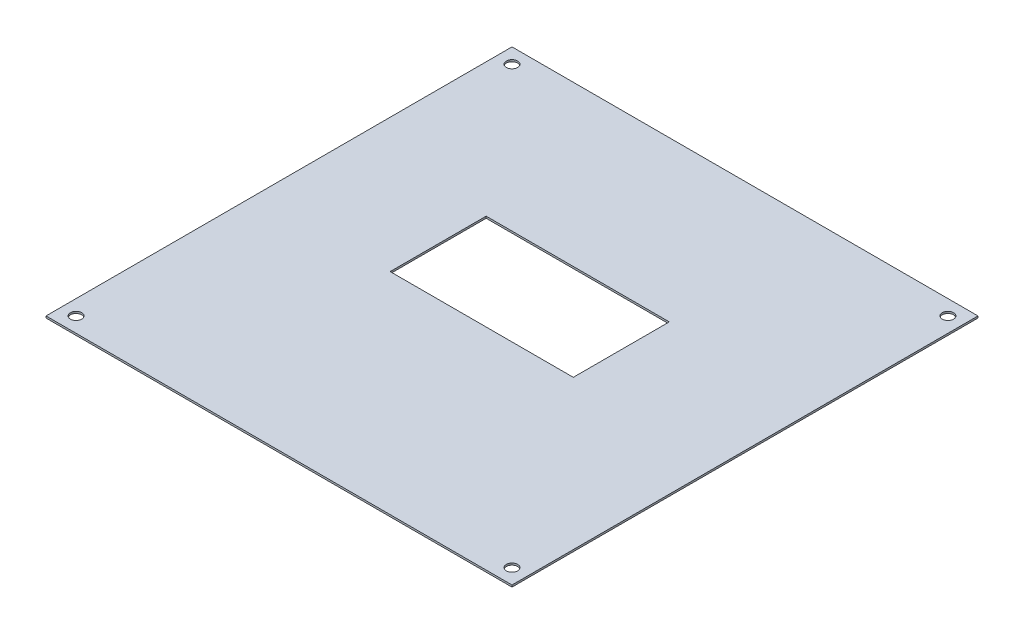
ISO-10303-21;
HEADER;
FILE_DESCRIPTION(('STEP AP214'),'2;1');
FILE_NAME('part.step','',(''),(''),'','','');
FILE_SCHEMA(('AUTOMOTIVE_DESIGN { 1 0 10303 214 1 1 1 1 }'));
ENDSEC;
DATA;
#1=APPLICATION_CONTEXT('core data for automotive mechanical design processes');
#2=APPLICATION_PROTOCOL_DEFINITION('international standard','automotive_design',2000,#1);
#3=PRODUCT_CONTEXT('',#1,'mechanical');
#4=PRODUCT('Part','Part','',(#3));
#5=PRODUCT_RELATED_PRODUCT_CATEGORY('part','',(#4));
#6=PRODUCT_DEFINITION_FORMATION('','',#4);
#7=PRODUCT_DEFINITION_CONTEXT('part definition',#1,'design');
#8=PRODUCT_DEFINITION('design','',#6,#7);
#9=PRODUCT_DEFINITION_SHAPE('','',#8);
#10=(LENGTH_UNIT() NAMED_UNIT(*) SI_UNIT(.MILLI.,.METRE.));
#11=(NAMED_UNIT(*) PLANE_ANGLE_UNIT() SI_UNIT($,.RADIAN.));
#12=(NAMED_UNIT(*) SI_UNIT($,.STERADIAN.) SOLID_ANGLE_UNIT());
#13=UNCERTAINTY_MEASURE_WITH_UNIT(LENGTH_MEASURE(1.E-05),#10,'distance_accuracy_value','');
#14=(GEOMETRIC_REPRESENTATION_CONTEXT(3) GLOBAL_UNCERTAINTY_ASSIGNED_CONTEXT((#13)) GLOBAL_UNIT_ASSIGNED_CONTEXT((#10,
#11,#12)) REPRESENTATION_CONTEXT('',''));
#15=CARTESIAN_POINT('',(0.,0.,0.));
#16=DIRECTION('',(0.,0.,1.));
#17=DIRECTION('',(1.,0.,0.));
#18=AXIS2_PLACEMENT_3D('',#15,#16,#17);
#19=CARTESIAN_POINT('',(0.,0.5,0.));
#20=DIRECTION('',(0.,-1.,0.));
#21=DIRECTION('',(0.,0.,-1.));
#22=AXIS2_PLACEMENT_3D('',#19,#20,#21);
#23=PLANE('',#22);
#24=CARTESIAN_POINT('',(120.,0.5,-4.));
#25=DIRECTION('',(0.,1.,0.));
#26=DIRECTION('',(0.,0.,1.));
#27=AXIS2_PLACEMENT_3D('',#24,#25,#26);
#28=CIRCLE('',#27,1.5);
#29=CARTESIAN_POINT('',(120.,0.5,-2.5));
#30=VERTEX_POINT('',#29);
#31=EDGE_CURVE('E250',#30,#30,#28,.T.);
#32=ORIENTED_EDGE('',*,*,#31,.F.);
#33=EDGE_LOOP('',(#32));
#34=FACE_BOUND('',#33,.T.);
#35=CARTESIAN_POINT('',(4.,0.5,-120.));
#36=DIRECTION('',(0.,1.,0.));
#37=DIRECTION('',(0.,0.,1.));
#38=AXIS2_PLACEMENT_3D('',#35,#36,#37);
#39=CIRCLE('',#38,1.5);
#40=CARTESIAN_POINT('',(4.,0.5,-118.5));
#41=VERTEX_POINT('',#40);
#42=EDGE_CURVE('E131',#41,#41,#39,.T.);
#43=ORIENTED_EDGE('',*,*,#42,.F.);
#44=EDGE_LOOP('',(#43));
#45=FACE_BOUND('',#44,.T.);
#46=DIRECTION('',(0.,0.,1.));
#47=VECTOR('',#46,1.);
#48=CARTESIAN_POINT('',(0.,0.5,0.));
#49=LINE('',#48,#47);
#50=CARTESIAN_POINT('',(0.,0.5,-124.));
#51=VERTEX_POINT('',#50);
#52=CARTESIAN_POINT('',(0.,0.5,0.));
#53=VERTEX_POINT('',#52);
#54=EDGE_CURVE('E141',#51,#53,#49,.T.);
#55=ORIENTED_EDGE('',*,*,#54,.T.);
#56=DIRECTION('',(1.,0.,0.));
#57=VECTOR('',#56,1.);
#58=CARTESIAN_POINT('',(0.,0.5,0.));
#59=LINE('',#58,#57);
#60=CARTESIAN_POINT('',(124.,0.5,0.));
#61=VERTEX_POINT('',#60);
#62=EDGE_CURVE('E144',#53,#61,#59,.T.);
#63=ORIENTED_EDGE('',*,*,#62,.T.);
#64=DIRECTION('',(0.,0.,-1.));
#65=VECTOR('',#64,1.);
#66=CARTESIAN_POINT('',(124.,0.5,0.));
#67=LINE('',#66,#65);
#68=CARTESIAN_POINT('',(124.,0.5,-124.));
#69=VERTEX_POINT('',#68);
#70=EDGE_CURVE('E147',#61,#69,#67,.T.);
#71=ORIENTED_EDGE('',*,*,#70,.T.);
#72=DIRECTION('',(-1.,0.,0.));
#73=VECTOR('',#72,1.);
#74=CARTESIAN_POINT('',(0.,0.5,-124.));
#75=LINE('',#74,#73);
#76=EDGE_CURVE('E149',#69,#51,#75,.T.);
#77=ORIENTED_EDGE('',*,*,#76,.T.);
#78=EDGE_LOOP('',(#55,#63,#71,#77));
#79=FACE_BOUND('',#78,.T.);
#80=DIRECTION('',(0.,0.,1.));
#81=VECTOR('',#80,1.);
#82=CARTESIAN_POINT('',(35.5689381933439,0.5,-81.5530903328051));
#83=LINE('',#82,#81);
#84=CARTESIAN_POINT('',(35.5689381933439,0.5,-81.5530903328051));
#85=VERTEX_POINT('',#84);
#86=CARTESIAN_POINT('',(35.5689381933439,0.5,-56.0063391442155));
#87=VERTEX_POINT('',#86);
#88=EDGE_CURVE('E102',#85,#87,#83,.T.);
#89=ORIENTED_EDGE('',*,*,#88,.F.);
#90=DIRECTION('',(-1.,0.,0.));
#91=VECTOR('',#90,1.);
#92=CARTESIAN_POINT('',(35.5689381933439,0.5,-81.5530903328051));
#93=LINE('',#92,#91);
#94=CARTESIAN_POINT('',(84.3042789223455,0.5,-81.5530903328051));
#95=VERTEX_POINT('',#94);
#96=EDGE_CURVE('E125',#95,#85,#93,.T.);
#97=ORIENTED_EDGE('',*,*,#96,.F.);
#98=DIRECTION('',(0.,0.,-1.));
#99=VECTOR('',#98,1.);
#100=CARTESIAN_POINT('',(84.3042789223455,0.5,-81.5530903328051));
#101=LINE('',#100,#99);
#102=CARTESIAN_POINT('',(84.3042789223455,0.5,-56.0063391442155));
#103=VERTEX_POINT('',#102);
#104=EDGE_CURVE('E123',#103,#95,#101,.T.);
#105=ORIENTED_EDGE('',*,*,#104,.F.);
#106=DIRECTION('',(1.,0.,0.));
#107=VECTOR('',#106,1.);
#108=CARTESIAN_POINT('',(35.5689381933439,0.5,-56.0063391442155));
#109=LINE('',#108,#107);
#110=EDGE_CURVE('E110',#87,#103,#109,.T.);
#111=ORIENTED_EDGE('',*,*,#110,.F.);
#112=EDGE_LOOP('',(#89,#97,#105,#111));
#113=FACE_BOUND('',#112,.T.);
#114=CARTESIAN_POINT('',(120.,0.5,-120.));
#115=DIRECTION('',(0.,1.,0.));
#116=DIRECTION('',(0.,0.,1.));
#117=AXIS2_PLACEMENT_3D('',#114,#115,#116);
#118=CIRCLE('',#117,1.5);
#119=CARTESIAN_POINT('',(120.,0.5,-118.5));
#120=VERTEX_POINT('',#119);
#121=EDGE_CURVE('E256',#120,#120,#118,.T.);
#122=ORIENTED_EDGE('',*,*,#121,.F.);
#123=EDGE_LOOP('',(#122));
#124=FACE_BOUND('',#123,.T.);
#125=CARTESIAN_POINT('',(4.,0.5,-4.));
#126=DIRECTION('',(0.,1.,0.));
#127=DIRECTION('',(0.,0.,1.));
#128=AXIS2_PLACEMENT_3D('',#125,#126,#127);
#129=CIRCLE('',#128,1.5);
#130=CARTESIAN_POINT('',(4.,0.5,-2.5));
#131=VERTEX_POINT('',#130);
#132=EDGE_CURVE('E241',#131,#131,#129,.T.);
#133=ORIENTED_EDGE('',*,*,#132,.F.);
#134=EDGE_LOOP('',(#133));
#135=FACE_BOUND('',#134,.T.);
#136=ADVANCED_FACE('F37',(#34,#45,#79,#113,#124,#135),#23,.F.);
#137=CARTESIAN_POINT('',(0.,0.,0.));
#138=DIRECTION('',(0.,-1.,0.));
#139=DIRECTION('',(0.,0.,-1.));
#140=AXIS2_PLACEMENT_3D('',#137,#138,#139);
#141=PLANE('',#140);
#142=CARTESIAN_POINT('',(120.,0.,-4.));
#143=DIRECTION('',(0.,1.,0.));
#144=DIRECTION('',(0.,0.,1.));
#145=AXIS2_PLACEMENT_3D('',#142,#143,#144);
#146=CIRCLE('',#145,1.5);
#147=CARTESIAN_POINT('',(120.,0.,-2.5));
#148=VERTEX_POINT('',#147);
#149=EDGE_CURVE('E247',#148,#148,#146,.T.);
#150=ORIENTED_EDGE('',*,*,#149,.T.);
#151=EDGE_LOOP('',(#150));
#152=FACE_BOUND('',#151,.T.);
#153=CARTESIAN_POINT('',(4.,0.,-120.));
#154=DIRECTION('',(0.,1.,0.));
#155=DIRECTION('',(0.,0.,1.));
#156=AXIS2_PLACEMENT_3D('',#153,#154,#155);
#157=CIRCLE('',#156,1.5);
#158=CARTESIAN_POINT('',(4.,0.,-118.5));
#159=VERTEX_POINT('',#158);
#160=EDGE_CURVE('E259',#159,#159,#157,.T.);
#161=ORIENTED_EDGE('',*,*,#160,.T.);
#162=EDGE_LOOP('',(#161));
#163=FACE_BOUND('',#162,.T.);
#164=DIRECTION('',(0.,0.,1.));
#165=VECTOR('',#164,1.);
#166=CARTESIAN_POINT('',(0.,0.,0.));
#167=LINE('',#166,#165);
#168=CARTESIAN_POINT('',(0.,0.,-124.));
#169=VERTEX_POINT('',#168);
#170=CARTESIAN_POINT('',(0.,0.,0.));
#171=VERTEX_POINT('',#170);
#172=EDGE_CURVE('E118',#169,#171,#167,.T.);
#173=ORIENTED_EDGE('',*,*,#172,.F.);
#174=DIRECTION('',(-1.,0.,0.));
#175=VECTOR('',#174,1.);
#176=CARTESIAN_POINT('',(0.,0.,-124.));
#177=LINE('',#176,#175);
#178=CARTESIAN_POINT('',(124.,0.,-124.));
#179=VERTEX_POINT('',#178);
#180=EDGE_CURVE('E145',#179,#169,#177,.T.);
#181=ORIENTED_EDGE('',*,*,#180,.F.);
#182=DIRECTION('',(0.,0.,-1.));
#183=VECTOR('',#182,1.);
#184=CARTESIAN_POINT('',(124.,0.,0.));
#185=LINE('',#184,#183);
#186=CARTESIAN_POINT('',(124.,0.,0.));
#187=VERTEX_POINT('',#186);
#188=EDGE_CURVE('E156',#187,#179,#185,.T.);
#189=ORIENTED_EDGE('',*,*,#188,.F.);
#190=DIRECTION('',(1.,0.,0.));
#191=VECTOR('',#190,1.);
#192=CARTESIAN_POINT('',(0.,0.,0.));
#193=LINE('',#192,#191);
#194=EDGE_CURVE('E154',#171,#187,#193,.T.);
#195=ORIENTED_EDGE('',*,*,#194,.F.);
#196=EDGE_LOOP('',(#173,#181,#189,#195));
#197=FACE_BOUND('',#196,.T.);
#198=DIRECTION('',(-1.,0.,0.));
#199=VECTOR('',#198,1.);
#200=CARTESIAN_POINT('',(35.5689381933439,0.,-81.5530903328051));
#201=LINE('',#200,#199);
#202=CARTESIAN_POINT('',(84.3042789223455,0.,-81.5530903328051));
#203=VERTEX_POINT('',#202);
#204=CARTESIAN_POINT('',(35.5689381933439,0.,-81.5530903328051));
#205=VERTEX_POINT('',#204);
#206=EDGE_CURVE('E111',#203,#205,#201,.T.);
#207=ORIENTED_EDGE('',*,*,#206,.T.);
#208=DIRECTION('',(0.,0.,1.));
#209=VECTOR('',#208,1.);
#210=CARTESIAN_POINT('',(35.5689381933439,0.,-81.5530903328051));
#211=LINE('',#210,#209);
#212=CARTESIAN_POINT('',(35.5689381933439,0.,-56.0063391442155));
#213=VERTEX_POINT('',#212);
#214=EDGE_CURVE('E60',#205,#213,#211,.T.);
#215=ORIENTED_EDGE('',*,*,#214,.T.);
#216=DIRECTION('',(1.,0.,0.));
#217=VECTOR('',#216,1.);
#218=CARTESIAN_POINT('',(35.5689381933439,0.,-56.0063391442155));
#219=LINE('',#218,#217);
#220=CARTESIAN_POINT('',(84.3042789223455,0.,-56.0063391442155));
#221=VERTEX_POINT('',#220);
#222=EDGE_CURVE('E117',#213,#221,#219,.T.);
#223=ORIENTED_EDGE('',*,*,#222,.T.);
#224=DIRECTION('',(0.,0.,-1.));
#225=VECTOR('',#224,1.);
#226=CARTESIAN_POINT('',(84.3042789223455,0.,-81.5530903328051));
#227=LINE('',#226,#225);
#228=EDGE_CURVE('E133',#221,#203,#227,.T.);
#229=ORIENTED_EDGE('',*,*,#228,.T.);
#230=EDGE_LOOP('',(#207,#215,#223,#229));
#231=FACE_BOUND('',#230,.T.);
#232=CARTESIAN_POINT('',(120.,0.,-120.));
#233=DIRECTION('',(0.,1.,0.));
#234=DIRECTION('',(0.,0.,1.));
#235=AXIS2_PLACEMENT_3D('',#232,#233,#234);
#236=CIRCLE('',#235,1.5);
#237=CARTESIAN_POINT('',(120.,0.,-118.5));
#238=VERTEX_POINT('',#237);
#239=EDGE_CURVE('E253',#238,#238,#236,.T.);
#240=ORIENTED_EDGE('',*,*,#239,.T.);
#241=EDGE_LOOP('',(#240));
#242=FACE_BOUND('',#241,.T.);
#243=CARTESIAN_POINT('',(4.,0.,-4.));
#244=DIRECTION('',(0.,1.,0.));
#245=DIRECTION('',(0.,0.,1.));
#246=AXIS2_PLACEMENT_3D('',#243,#244,#245);
#247=CIRCLE('',#246,1.5);
#248=CARTESIAN_POINT('',(4.,0.,-2.5));
#249=VERTEX_POINT('',#248);
#250=EDGE_CURVE('E244',#249,#249,#247,.T.);
#251=ORIENTED_EDGE('',*,*,#250,.T.);
#252=EDGE_LOOP('',(#251));
#253=FACE_BOUND('',#252,.T.);
#254=ADVANCED_FACE('F174',(#152,#163,#197,#231,#242,#253),#141,.T.);
#255=CARTESIAN_POINT('',(0.,0.5,0.));
#256=DIRECTION('',(1.,0.,0.));
#257=DIRECTION('',(0.,0.,-1.));
#258=AXIS2_PLACEMENT_3D('',#255,#256,#257);
#259=PLANE('',#258);
#260=ORIENTED_EDGE('',*,*,#172,.T.);
#261=DIRECTION('',(0.,-1.,0.));
#262=VECTOR('',#261,1.);
#263=CARTESIAN_POINT('',(0.,0.5,0.));
#264=LINE('',#263,#262);
#265=EDGE_CURVE('E11',#53,#171,#264,.T.);
#266=ORIENTED_EDGE('',*,*,#265,.F.);
#267=ORIENTED_EDGE('',*,*,#54,.F.);
#268=DIRECTION('',(0.,-1.,0.));
#269=VECTOR('',#268,1.);
#270=CARTESIAN_POINT('',(0.,0.5,-124.));
#271=LINE('',#270,#269);
#272=EDGE_CURVE('E151',#51,#169,#271,.T.);
#273=ORIENTED_EDGE('',*,*,#272,.T.);
#274=EDGE_LOOP('',(#260,#266,#267,#273));
#275=FACE_BOUND('',#274,.T.);
#276=ADVANCED_FACE('F39',(#275),#259,.F.);
#277=CARTESIAN_POINT('',(0.,0.5,0.));
#278=DIRECTION('',(0.,0.,-1.));
#279=DIRECTION('',(-1.,0.,0.));
#280=AXIS2_PLACEMENT_3D('',#277,#278,#279);
#281=PLANE('',#280);
#282=ORIENTED_EDGE('',*,*,#194,.T.);
#283=DIRECTION('',(0.,-1.,0.));
#284=VECTOR('',#283,1.);
#285=CARTESIAN_POINT('',(124.,0.5,0.));
#286=LINE('',#285,#284);
#287=EDGE_CURVE('E45',#61,#187,#286,.T.);
#288=ORIENTED_EDGE('',*,*,#287,.F.);
#289=ORIENTED_EDGE('',*,*,#62,.F.);
#290=ORIENTED_EDGE('',*,*,#265,.T.);
#291=EDGE_LOOP('',(#282,#288,#289,#290));
#292=FACE_BOUND('',#291,.T.);
#293=ADVANCED_FACE('F184',(#292),#281,.F.);
#294=CARTESIAN_POINT('',(124.,0.5,0.));
#295=DIRECTION('',(-1.,0.,0.));
#296=DIRECTION('',(0.,0.,1.));
#297=AXIS2_PLACEMENT_3D('',#294,#295,#296);
#298=PLANE('',#297);
#299=ORIENTED_EDGE('',*,*,#188,.T.);
#300=DIRECTION('',(0.,-1.,0.));
#301=VECTOR('',#300,1.);
#302=CARTESIAN_POINT('',(124.,0.5,-124.));
#303=LINE('',#302,#301);
#304=EDGE_CURVE('E161',#69,#179,#303,.T.);
#305=ORIENTED_EDGE('',*,*,#304,.F.);
#306=ORIENTED_EDGE('',*,*,#70,.F.);
#307=ORIENTED_EDGE('',*,*,#287,.T.);
#308=EDGE_LOOP('',(#299,#305,#306,#307));
#309=FACE_BOUND('',#308,.T.);
#310=ADVANCED_FACE('F168',(#309),#298,.F.);
#311=CARTESIAN_POINT('',(0.,0.5,-124.));
#312=DIRECTION('',(0.,0.,1.));
#313=DIRECTION('',(1.,0.,0.));
#314=AXIS2_PLACEMENT_3D('',#311,#312,#313);
#315=PLANE('',#314);
#316=ORIENTED_EDGE('',*,*,#180,.T.);
#317=ORIENTED_EDGE('',*,*,#272,.F.);
#318=ORIENTED_EDGE('',*,*,#76,.F.);
#319=ORIENTED_EDGE('',*,*,#304,.T.);
#320=EDGE_LOOP('',(#316,#317,#318,#319));
#321=FACE_BOUND('',#320,.T.);
#322=ADVANCED_FACE('F178',(#321),#315,.F.);
#323=CARTESIAN_POINT('',(35.5689381933439,0.5,-81.5530903328051));
#324=DIRECTION('',(1.,0.,0.));
#325=DIRECTION('',(0.,0.,-1.));
#326=AXIS2_PLACEMENT_3D('',#323,#324,#325);
#327=PLANE('',#326);
#328=ORIENTED_EDGE('',*,*,#214,.F.);
#329=DIRECTION('',(0.,-1.,0.));
#330=VECTOR('',#329,1.);
#331=CARTESIAN_POINT('',(35.5689381933439,0.5,-81.5530903328051));
#332=LINE('',#331,#330);
#333=EDGE_CURVE('E106',#85,#205,#332,.T.);
#334=ORIENTED_EDGE('',*,*,#333,.F.);
#335=ORIENTED_EDGE('',*,*,#88,.T.);
#336=DIRECTION('',(0.,-1.,0.));
#337=VECTOR('',#336,1.);
#338=CARTESIAN_POINT('',(35.5689381933439,0.5,-56.0063391442155));
#339=LINE('',#338,#337);
#340=EDGE_CURVE('E105',#87,#213,#339,.T.);
#341=ORIENTED_EDGE('',*,*,#340,.T.);
#342=EDGE_LOOP('',(#328,#334,#335,#341));
#343=FACE_BOUND('',#342,.T.);
#344=ADVANCED_FACE('F104',(#343),#327,.T.);
#345=CARTESIAN_POINT('',(35.5689381933439,0.5,-56.0063391442155));
#346=DIRECTION('',(0.,0.,-1.));
#347=DIRECTION('',(-1.,0.,0.));
#348=AXIS2_PLACEMENT_3D('',#345,#346,#347);
#349=PLANE('',#348);
#350=ORIENTED_EDGE('',*,*,#222,.F.);
#351=ORIENTED_EDGE('',*,*,#340,.F.);
#352=ORIENTED_EDGE('',*,*,#110,.T.);
#353=DIRECTION('',(0.,-1.,0.));
#354=VECTOR('',#353,1.);
#355=CARTESIAN_POINT('',(84.3042789223455,0.5,-56.0063391442155));
#356=LINE('',#355,#354);
#357=EDGE_CURVE('E119',#103,#221,#356,.T.);
#358=ORIENTED_EDGE('',*,*,#357,.T.);
#359=EDGE_LOOP('',(#350,#351,#352,#358));
#360=FACE_BOUND('',#359,.T.);
#361=ADVANCED_FACE('F114',(#360),#349,.T.);
#362=CARTESIAN_POINT('',(84.3042789223455,0.5,-81.5530903328051));
#363=DIRECTION('',(-1.,0.,0.));
#364=DIRECTION('',(0.,0.,1.));
#365=AXIS2_PLACEMENT_3D('',#362,#363,#364);
#366=PLANE('',#365);
#367=ORIENTED_EDGE('',*,*,#228,.F.);
#368=ORIENTED_EDGE('',*,*,#357,.F.);
#369=ORIENTED_EDGE('',*,*,#104,.T.);
#370=DIRECTION('',(0.,-1.,0.));
#371=VECTOR('',#370,1.);
#372=CARTESIAN_POINT('',(84.3042789223455,0.5,-81.5530903328051));
#373=LINE('',#372,#371);
#374=EDGE_CURVE('E52',#95,#203,#373,.T.);
#375=ORIENTED_EDGE('',*,*,#374,.T.);
#376=EDGE_LOOP('',(#367,#368,#369,#375));
#377=FACE_BOUND('',#376,.T.);
#378=ADVANCED_FACE('F211',(#377),#366,.T.);
#379=CARTESIAN_POINT('',(35.5689381933439,0.5,-81.5530903328051));
#380=DIRECTION('',(0.,0.,1.));
#381=DIRECTION('',(1.,0.,0.));
#382=AXIS2_PLACEMENT_3D('',#379,#380,#381);
#383=PLANE('',#382);
#384=ORIENTED_EDGE('',*,*,#206,.F.);
#385=ORIENTED_EDGE('',*,*,#374,.F.);
#386=ORIENTED_EDGE('',*,*,#96,.T.);
#387=ORIENTED_EDGE('',*,*,#333,.T.);
#388=EDGE_LOOP('',(#384,#385,#386,#387));
#389=FACE_BOUND('',#388,.T.);
#390=ADVANCED_FACE('F215',(#389),#383,.T.);
#391=CARTESIAN_POINT('',(4.,0.5,-120.));
#392=DIRECTION('',(0.,-1.,0.));
#393=DIRECTION('',(0.,0.,-1.));
#394=AXIS2_PLACEMENT_3D('',#391,#392,#393);
#395=CYLINDRICAL_SURFACE('',#394,1.5);
#396=ORIENTED_EDGE('',*,*,#42,.T.);
#397=EDGE_LOOP('',(#396));
#398=FACE_BOUND('',#397,.T.);
#399=ORIENTED_EDGE('',*,*,#160,.F.);
#400=EDGE_LOOP('',(#399));
#401=FACE_BOUND('',#400,.T.);
#402=ADVANCED_FACE('F221',(#398,#401),#395,.F.);
#403=CARTESIAN_POINT('',(120.,0.5,-120.));
#404=DIRECTION('',(0.,-1.,0.));
#405=DIRECTION('',(0.,0.,-1.));
#406=AXIS2_PLACEMENT_3D('',#403,#404,#405);
#407=CYLINDRICAL_SURFACE('',#406,1.5);
#408=ORIENTED_EDGE('',*,*,#121,.T.);
#409=EDGE_LOOP('',(#408));
#410=FACE_BOUND('',#409,.T.);
#411=ORIENTED_EDGE('',*,*,#239,.F.);
#412=EDGE_LOOP('',(#411));
#413=FACE_BOUND('',#412,.T.);
#414=ADVANCED_FACE('F224',(#410,#413),#407,.F.);
#415=CARTESIAN_POINT('',(120.,0.5,-4.));
#416=DIRECTION('',(0.,-1.,0.));
#417=DIRECTION('',(0.,0.,-1.));
#418=AXIS2_PLACEMENT_3D('',#415,#416,#417);
#419=CYLINDRICAL_SURFACE('',#418,1.5);
#420=ORIENTED_EDGE('',*,*,#31,.T.);
#421=EDGE_LOOP('',(#420));
#422=FACE_BOUND('',#421,.T.);
#423=ORIENTED_EDGE('',*,*,#149,.F.);
#424=EDGE_LOOP('',(#423));
#425=FACE_BOUND('',#424,.T.);
#426=ADVANCED_FACE('F228',(#422,#425),#419,.F.);
#427=CARTESIAN_POINT('',(4.,0.5,-4.));
#428=DIRECTION('',(0.,-1.,0.));
#429=DIRECTION('',(0.,0.,-1.));
#430=AXIS2_PLACEMENT_3D('',#427,#428,#429);
#431=CYLINDRICAL_SURFACE('',#430,1.5);
#432=ORIENTED_EDGE('',*,*,#132,.T.);
#433=EDGE_LOOP('',(#432));
#434=FACE_BOUND('',#433,.T.);
#435=ORIENTED_EDGE('',*,*,#250,.F.);
#436=EDGE_LOOP('',(#435));
#437=FACE_BOUND('',#436,.T.);
#438=ADVANCED_FACE('F232',(#434,#437),#431,.F.);
#439=CLOSED_SHELL('',(#136,#254,#276,#293,#310,#322,#344,#361,#378,#390,#402,#414,#426,#438));
#440=MANIFOLD_SOLID_BREP('B2',#439);
#441=ADVANCED_BREP_SHAPE_REPRESENTATION('',(#18,#440),#14);
#442=SHAPE_DEFINITION_REPRESENTATION(#9,#441);
ENDSEC;
END-ISO-10303-21;
